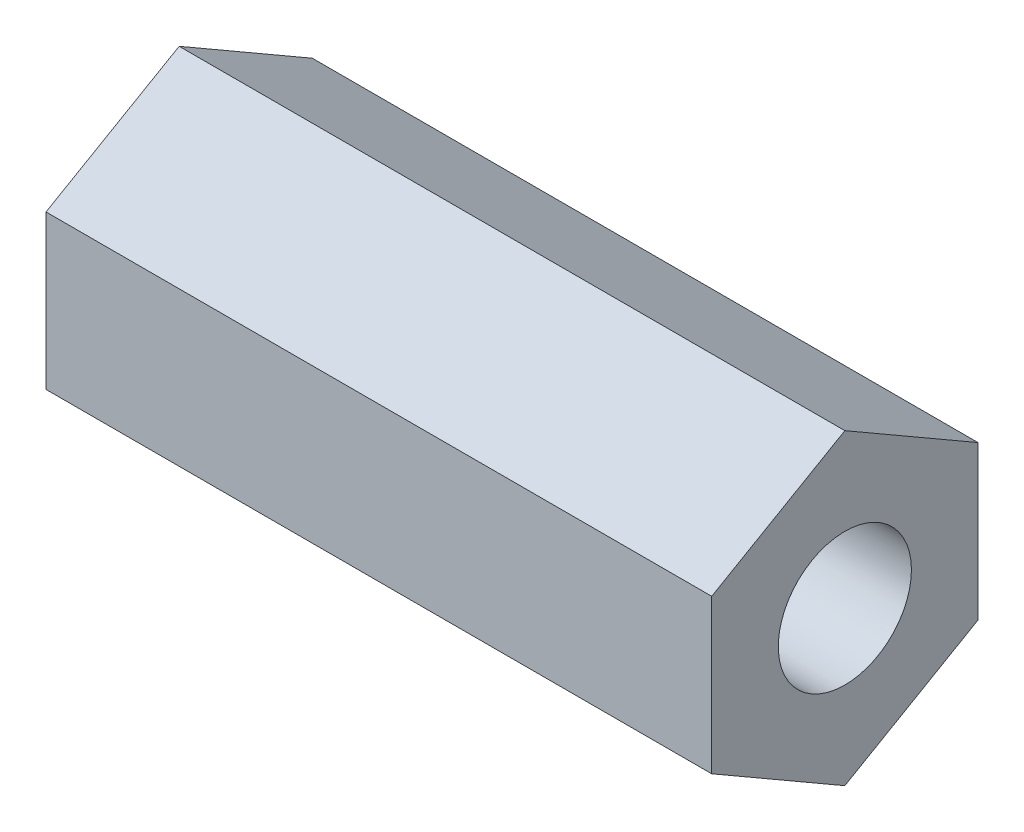
ISO-10303-21;
HEADER;
FILE_DESCRIPTION(('STEP AP214'),'2;1');
FILE_NAME('part.step','',(''),(''),'','','');
FILE_SCHEMA(('AUTOMOTIVE_DESIGN { 1 0 10303 214 1 1 1 1 }'));
ENDSEC;
DATA;
#1=APPLICATION_CONTEXT('core data for automotive mechanical design processes');
#2=APPLICATION_PROTOCOL_DEFINITION('international standard','automotive_design',2000,#1);
#3=PRODUCT_CONTEXT('',#1,'mechanical');
#4=PRODUCT('Part','Part','',(#3));
#5=PRODUCT_RELATED_PRODUCT_CATEGORY('part','',(#4));
#6=PRODUCT_DEFINITION_FORMATION('','',#4);
#7=PRODUCT_DEFINITION_CONTEXT('part definition',#1,'design');
#8=PRODUCT_DEFINITION('design','',#6,#7);
#9=PRODUCT_DEFINITION_SHAPE('','',#8);
#10=(LENGTH_UNIT() NAMED_UNIT(*) SI_UNIT(.MILLI.,.METRE.));
#11=(NAMED_UNIT(*) PLANE_ANGLE_UNIT() SI_UNIT($,.RADIAN.));
#12=(NAMED_UNIT(*) SI_UNIT($,.STERADIAN.) SOLID_ANGLE_UNIT());
#13=UNCERTAINTY_MEASURE_WITH_UNIT(LENGTH_MEASURE(1.E-05),#10,'distance_accuracy_value','');
#14=(GEOMETRIC_REPRESENTATION_CONTEXT(3) GLOBAL_UNCERTAINTY_ASSIGNED_CONTEXT((#13)) GLOBAL_UNIT_ASSIGNED_CONTEXT((#10,
#11,#12)) REPRESENTATION_CONTEXT('',''));
#15=CARTESIAN_POINT('',(0.,0.,0.));
#16=DIRECTION('',(0.,0.,1.));
#17=DIRECTION('',(1.,0.,0.));
#18=AXIS2_PLACEMENT_3D('',#15,#16,#17);
#19=CARTESIAN_POINT('',(15.,0.,0.));
#20=DIRECTION('',(1.,0.,0.));
#21=DIRECTION('',(0.,0.,-1.));
#22=AXIS2_PLACEMENT_3D('',#19,#20,#21);
#23=PLANE('',#22);
#24=DIRECTION('',(0.,-0.5,0.866025403784438));
#25=VECTOR('',#24,1.);
#26=CARTESIAN_POINT('',(15.,3.46410161513776,0.));
#27=LINE('',#26,#25);
#28=CARTESIAN_POINT('',(15.,3.46410161513776,0.));
#29=VERTEX_POINT('',#28);
#30=CARTESIAN_POINT('',(15.,1.73205080756888,3.));
#31=VERTEX_POINT('',#30);
#32=EDGE_CURVE('E128',#29,#31,#27,.T.);
#33=ORIENTED_EDGE('',*,*,#32,.T.);
#34=DIRECTION('',(0.,-1.,0.));
#35=VECTOR('',#34,1.);
#36=CARTESIAN_POINT('',(15.,1.73205080756888,3.));
#37=LINE('',#36,#35);
#38=CARTESIAN_POINT('',(15.,-1.73205080756888,3.));
#39=VERTEX_POINT('',#38);
#40=EDGE_CURVE('E86',#31,#39,#37,.T.);
#41=ORIENTED_EDGE('',*,*,#40,.T.);
#42=DIRECTION('',(0.,-0.5,-0.866025403784438));
#43=VECTOR('',#42,1.);
#44=CARTESIAN_POINT('',(15.,-1.73205080756888,3.));
#45=LINE('',#44,#43);
#46=CARTESIAN_POINT('',(15.,-3.46410161513776,0.));
#47=VERTEX_POINT('',#46);
#48=EDGE_CURVE('E99',#39,#47,#45,.T.);
#49=ORIENTED_EDGE('',*,*,#48,.T.);
#50=DIRECTION('',(0.,0.5,-0.866025403784438));
#51=VECTOR('',#50,1.);
#52=CARTESIAN_POINT('',(15.,-3.46410161513776,0.));
#53=LINE('',#52,#51);
#54=CARTESIAN_POINT('',(15.,-1.73205080756888,-3.));
#55=VERTEX_POINT('',#54);
#56=EDGE_CURVE('E93',#47,#55,#53,.T.);
#57=ORIENTED_EDGE('',*,*,#56,.T.);
#58=DIRECTION('',(0.,1.,0.));
#59=VECTOR('',#58,1.);
#60=CARTESIAN_POINT('',(15.,-1.73205080756888,-3.));
#61=LINE('',#60,#59);
#62=CARTESIAN_POINT('',(15.,1.73205080756888,-3.));
#63=VERTEX_POINT('',#62);
#64=EDGE_CURVE('E97',#55,#63,#61,.T.);
#65=ORIENTED_EDGE('',*,*,#64,.T.);
#66=DIRECTION('',(0.,0.5,0.866025403784439));
#67=VECTOR('',#66,1.);
#68=CARTESIAN_POINT('',(15.,1.73205080756888,-3.));
#69=LINE('',#68,#67);
#70=EDGE_CURVE('E49',#63,#29,#69,.T.);
#71=ORIENTED_EDGE('',*,*,#70,.T.);
#72=EDGE_LOOP('',(#33,#41,#49,#57,#65,#71));
#73=FACE_BOUND('',#72,.T.);
#74=CARTESIAN_POINT('',(15.,0.,0.));
#75=DIRECTION('',(1.,0.,0.));
#76=DIRECTION('',(0.,0.,-1.));
#77=AXIS2_PLACEMENT_3D('',#74,#75,#76);
#78=CIRCLE('',#77,1.5);
#79=CARTESIAN_POINT('',(15.,0.,-1.5));
#80=VERTEX_POINT('',#79);
#81=EDGE_CURVE('E121',#80,#80,#78,.T.);
#82=ORIENTED_EDGE('',*,*,#81,.F.);
#83=EDGE_LOOP('',(#82));
#84=FACE_BOUND('',#83,.T.);
#85=ADVANCED_FACE('F32',(#73,#84),#23,.T.);
#86=CARTESIAN_POINT('',(0.,0.,0.));
#87=DIRECTION('',(1.,0.,0.));
#88=DIRECTION('',(0.,0.,-1.));
#89=AXIS2_PLACEMENT_3D('',#86,#87,#88);
#90=PLANE('',#89);
#91=DIRECTION('',(0.,-0.5,0.866025403784438));
#92=VECTOR('',#91,1.);
#93=CARTESIAN_POINT('',(0.,3.46410161513776,0.));
#94=LINE('',#93,#92);
#95=CARTESIAN_POINT('',(0.,3.46410161513776,0.));
#96=VERTEX_POINT('',#95);
#97=CARTESIAN_POINT('',(0.,1.73205080756888,3.));
#98=VERTEX_POINT('',#97);
#99=EDGE_CURVE('E117',#96,#98,#94,.T.);
#100=ORIENTED_EDGE('',*,*,#99,.F.);
#101=DIRECTION('',(0.,0.5,0.866025403784439));
#102=VECTOR('',#101,1.);
#103=CARTESIAN_POINT('',(0.,1.73205080756888,-3.));
#104=LINE('',#103,#102);
#105=CARTESIAN_POINT('',(0.,1.73205080756888,-3.));
#106=VERTEX_POINT('',#105);
#107=EDGE_CURVE('E78',#106,#96,#104,.T.);
#108=ORIENTED_EDGE('',*,*,#107,.F.);
#109=DIRECTION('',(0.,1.,0.));
#110=VECTOR('',#109,1.);
#111=CARTESIAN_POINT('',(0.,-1.73205080756888,-3.));
#112=LINE('',#111,#110);
#113=CARTESIAN_POINT('',(0.,-1.73205080756888,-3.));
#114=VERTEX_POINT('',#113);
#115=EDGE_CURVE('E72',#114,#106,#112,.T.);
#116=ORIENTED_EDGE('',*,*,#115,.F.);
#117=DIRECTION('',(0.,0.5,-0.866025403784438));
#118=VECTOR('',#117,1.);
#119=CARTESIAN_POINT('',(0.,-3.46410161513776,0.));
#120=LINE('',#119,#118);
#121=CARTESIAN_POINT('',(0.,-3.46410161513776,0.));
#122=VERTEX_POINT('',#121);
#123=EDGE_CURVE('E107',#122,#114,#120,.T.);
#124=ORIENTED_EDGE('',*,*,#123,.F.);
#125=DIRECTION('',(0.,-0.5,-0.866025403784438));
#126=VECTOR('',#125,1.);
#127=CARTESIAN_POINT('',(0.,-1.73205080756888,3.));
#128=LINE('',#127,#126);
#129=CARTESIAN_POINT('',(0.,-1.73205080756888,3.));
#130=VERTEX_POINT('',#129);
#131=EDGE_CURVE('E123',#130,#122,#128,.T.);
#132=ORIENTED_EDGE('',*,*,#131,.F.);
#133=DIRECTION('',(0.,-1.,0.));
#134=VECTOR('',#133,1.);
#135=CARTESIAN_POINT('',(0.,1.73205080756888,3.));
#136=LINE('',#135,#134);
#137=EDGE_CURVE('E120',#98,#130,#136,.T.);
#138=ORIENTED_EDGE('',*,*,#137,.F.);
#139=EDGE_LOOP('',(#100,#108,#116,#124,#132,#138));
#140=FACE_BOUND('',#139,.T.);
#141=CARTESIAN_POINT('',(0.,0.,0.));
#142=DIRECTION('',(1.,0.,0.));
#143=DIRECTION('',(0.,0.,-1.));
#144=AXIS2_PLACEMENT_3D('',#141,#142,#143);
#145=CIRCLE('',#144,1.5);
#146=CARTESIAN_POINT('',(0.,0.,-1.5));
#147=VERTEX_POINT('',#146);
#148=EDGE_CURVE('E221',#147,#147,#145,.T.);
#149=ORIENTED_EDGE('',*,*,#148,.T.);
#150=EDGE_LOOP('',(#149));
#151=FACE_BOUND('',#150,.T.);
#152=ADVANCED_FACE('F137',(#140,#151),#90,.F.);
#153=CARTESIAN_POINT('',(15.,3.46410161513776,0.));
#154=DIRECTION('',(0.,-0.866025403784438,-0.5));
#155=DIRECTION('',(0.,0.5,-0.866025403784439));
#156=AXIS2_PLACEMENT_3D('',#153,#154,#155);
#157=PLANE('',#156);
#158=ORIENTED_EDGE('',*,*,#99,.T.);
#159=DIRECTION('',(-1.,0.,0.));
#160=VECTOR('',#159,1.);
#161=CARTESIAN_POINT('',(15.,1.73205080756888,3.));
#162=LINE('',#161,#160);
#163=EDGE_CURVE('E11',#31,#98,#162,.T.);
#164=ORIENTED_EDGE('',*,*,#163,.F.);
#165=ORIENTED_EDGE('',*,*,#32,.F.);
#166=DIRECTION('',(-1.,0.,0.));
#167=VECTOR('',#166,1.);
#168=CARTESIAN_POINT('',(15.,3.46410161513776,0.));
#169=LINE('',#168,#167);
#170=EDGE_CURVE('E113',#29,#96,#169,.T.);
#171=ORIENTED_EDGE('',*,*,#170,.T.);
#172=EDGE_LOOP('',(#158,#164,#165,#171));
#173=FACE_BOUND('',#172,.T.);
#174=ADVANCED_FACE('F34',(#173),#157,.F.);
#175=CARTESIAN_POINT('',(15.,1.73205080756888,3.));
#176=DIRECTION('',(0.,0.,-1.));
#177=DIRECTION('',(-1.,0.,0.));
#178=AXIS2_PLACEMENT_3D('',#175,#176,#177);
#179=PLANE('',#178);
#180=ORIENTED_EDGE('',*,*,#137,.T.);
#181=DIRECTION('',(-1.,0.,0.));
#182=VECTOR('',#181,1.);
#183=CARTESIAN_POINT('',(15.,-1.73205080756888,3.));
#184=LINE('',#183,#182);
#185=EDGE_CURVE('E41',#39,#130,#184,.T.);
#186=ORIENTED_EDGE('',*,*,#185,.F.);
#187=ORIENTED_EDGE('',*,*,#40,.F.);
#188=ORIENTED_EDGE('',*,*,#163,.T.);
#189=EDGE_LOOP('',(#180,#186,#187,#188));
#190=FACE_BOUND('',#189,.T.);
#191=ADVANCED_FACE('F162',(#190),#179,.F.);
#192=CARTESIAN_POINT('',(15.,-1.73205080756888,3.));
#193=DIRECTION('',(0.,0.866025403784438,-0.5));
#194=DIRECTION('',(0.,0.5,0.866025403784439));
#195=AXIS2_PLACEMENT_3D('',#192,#193,#194);
#196=PLANE('',#195);
#197=ORIENTED_EDGE('',*,*,#131,.T.);
#198=DIRECTION('',(-1.,0.,0.));
#199=VECTOR('',#198,1.);
#200=CARTESIAN_POINT('',(15.,-3.46410161513776,0.));
#201=LINE('',#200,#199);
#202=EDGE_CURVE('E108',#47,#122,#201,.T.);
#203=ORIENTED_EDGE('',*,*,#202,.F.);
#204=ORIENTED_EDGE('',*,*,#48,.F.);
#205=ORIENTED_EDGE('',*,*,#185,.T.);
#206=EDGE_LOOP('',(#197,#203,#204,#205));
#207=FACE_BOUND('',#206,.T.);
#208=ADVANCED_FACE('F134',(#207),#196,.F.);
#209=CARTESIAN_POINT('',(15.,-3.46410161513776,0.));
#210=DIRECTION('',(0.,0.866025403784438,0.5));
#211=DIRECTION('',(0.,-0.5,0.866025403784439));
#212=AXIS2_PLACEMENT_3D('',#209,#210,#211);
#213=PLANE('',#212);
#214=ORIENTED_EDGE('',*,*,#123,.T.);
#215=DIRECTION('',(-1.,0.,0.));
#216=VECTOR('',#215,1.);
#217=CARTESIAN_POINT('',(15.,-1.73205080756888,-3.));
#218=LINE('',#217,#216);
#219=EDGE_CURVE('E104',#55,#114,#218,.T.);
#220=ORIENTED_EDGE('',*,*,#219,.F.);
#221=ORIENTED_EDGE('',*,*,#56,.F.);
#222=ORIENTED_EDGE('',*,*,#202,.T.);
#223=EDGE_LOOP('',(#214,#220,#221,#222));
#224=FACE_BOUND('',#223,.T.);
#225=ADVANCED_FACE('F105',(#224),#213,.F.);
#226=CARTESIAN_POINT('',(15.,-1.73205080756888,-3.));
#227=DIRECTION('',(0.,0.,1.));
#228=DIRECTION('',(0.,-1.,0.));
#229=AXIS2_PLACEMENT_3D('',#226,#227,#228);
#230=PLANE('',#229);
#231=ORIENTED_EDGE('',*,*,#115,.T.);
#232=DIRECTION('',(-1.,0.,0.));
#233=VECTOR('',#232,1.);
#234=CARTESIAN_POINT('',(15.,1.73205080756888,-3.));
#235=LINE('',#234,#233);
#236=EDGE_CURVE('E109',#63,#106,#235,.T.);
#237=ORIENTED_EDGE('',*,*,#236,.F.);
#238=ORIENTED_EDGE('',*,*,#64,.F.);
#239=ORIENTED_EDGE('',*,*,#219,.T.);
#240=EDGE_LOOP('',(#231,#237,#238,#239));
#241=FACE_BOUND('',#240,.T.);
#242=ADVANCED_FACE('F111',(#241),#230,.F.);
#243=CARTESIAN_POINT('',(15.,1.73205080756888,-3.));
#244=DIRECTION('',(0.,-0.866025403784438,0.5));
#245=DIRECTION('',(0.,-0.5,-0.866025403784439));
#246=AXIS2_PLACEMENT_3D('',#243,#244,#245);
#247=PLANE('',#246);
#248=ORIENTED_EDGE('',*,*,#107,.T.);
#249=ORIENTED_EDGE('',*,*,#170,.F.);
#250=ORIENTED_EDGE('',*,*,#70,.F.);
#251=ORIENTED_EDGE('',*,*,#236,.T.);
#252=EDGE_LOOP('',(#248,#249,#250,#251));
#253=FACE_BOUND('',#252,.T.);
#254=ADVANCED_FACE('F142',(#253),#247,.F.);
#255=CARTESIAN_POINT('',(15.,0.,0.));
#256=DIRECTION('',(-1.,0.,0.));
#257=DIRECTION('',(0.,0.,1.));
#258=AXIS2_PLACEMENT_3D('',#255,#256,#257);
#259=CYLINDRICAL_SURFACE('',#258,1.5);
#260=ORIENTED_EDGE('',*,*,#81,.T.);
#261=EDGE_LOOP('',(#260));
#262=FACE_BOUND('',#261,.T.);
#263=ORIENTED_EDGE('',*,*,#148,.F.);
#264=EDGE_LOOP('',(#263));
#265=FACE_BOUND('',#264,.T.);
#266=ADVANCED_FACE('F144',(#262,#265),#259,.F.);
#267=CLOSED_SHELL('',(#85,#152,#174,#191,#208,#225,#242,#254,#266));
#268=MANIFOLD_SOLID_BREP('B2',#267);
#269=ADVANCED_BREP_SHAPE_REPRESENTATION('',(#18,#268),#14);
#270=SHAPE_DEFINITION_REPRESENTATION(#9,#269);
ENDSEC;
END-ISO-10303-21;
